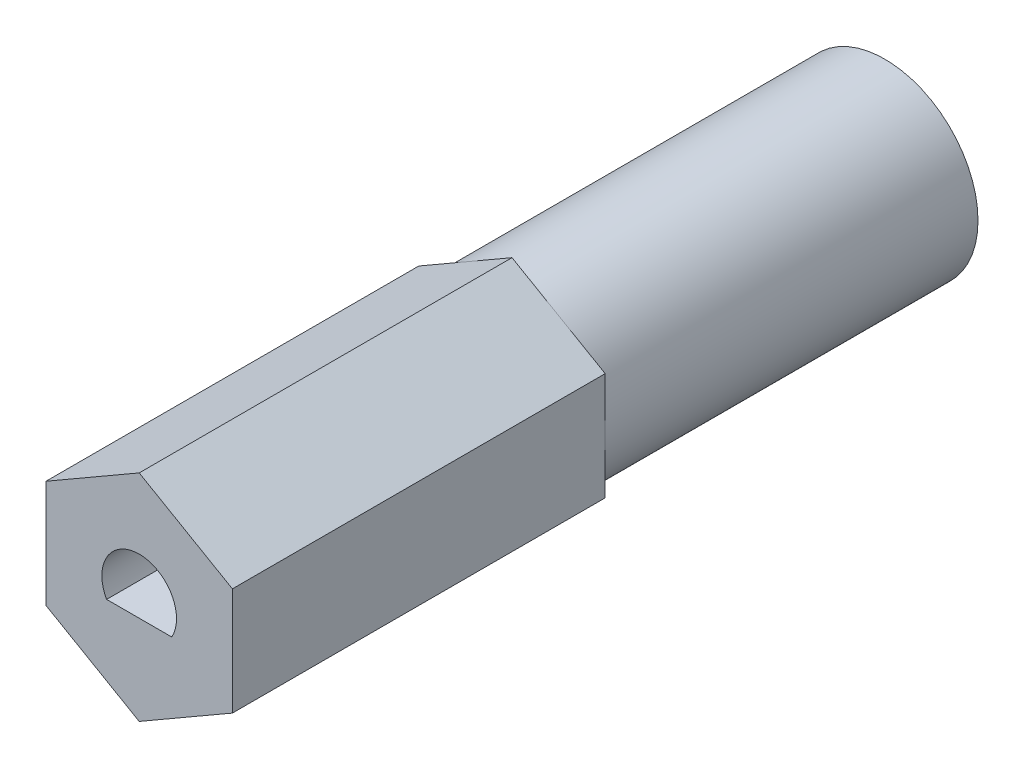
ISO-10303-21;
HEADER;
FILE_DESCRIPTION(('STEP AP214'),'2;1');
FILE_NAME('part.step','',(''),(''),'','','');
FILE_SCHEMA(('AUTOMOTIVE_DESIGN { 1 0 10303 214 1 1 1 1 }'));
ENDSEC;
DATA;
#1=APPLICATION_CONTEXT('core data for automotive mechanical design processes');
#2=APPLICATION_PROTOCOL_DEFINITION('international standard','automotive_design',2000,#1);
#3=PRODUCT_CONTEXT('',#1,'mechanical');
#4=PRODUCT('Part','Part','',(#3));
#5=PRODUCT_RELATED_PRODUCT_CATEGORY('part','',(#4));
#6=PRODUCT_DEFINITION_FORMATION('','',#4);
#7=PRODUCT_DEFINITION_CONTEXT('part definition',#1,'design');
#8=PRODUCT_DEFINITION('design','',#6,#7);
#9=PRODUCT_DEFINITION_SHAPE('','',#8);
#10=(LENGTH_UNIT() NAMED_UNIT(*) SI_UNIT(.MILLI.,.METRE.));
#11=(NAMED_UNIT(*) PLANE_ANGLE_UNIT() SI_UNIT($,.RADIAN.));
#12=(NAMED_UNIT(*) SI_UNIT($,.STERADIAN.) SOLID_ANGLE_UNIT());
#13=UNCERTAINTY_MEASURE_WITH_UNIT(LENGTH_MEASURE(1.E-05),#10,'distance_accuracy_value','');
#14=(GEOMETRIC_REPRESENTATION_CONTEXT(3) GLOBAL_UNCERTAINTY_ASSIGNED_CONTEXT((#13)) GLOBAL_UNIT_ASSIGNED_CONTEXT((#10,
#11,#12)) REPRESENTATION_CONTEXT('',''));
#15=CARTESIAN_POINT('',(0.,0.,0.));
#16=DIRECTION('',(0.,0.,1.));
#17=DIRECTION('',(1.,0.,0.));
#18=AXIS2_PLACEMENT_3D('',#15,#16,#17);
#19=CARTESIAN_POINT('',(3.175,1.83308710467706,-25.4));
#20=DIRECTION('',(0.5,0.866025403784439,0.));
#21=DIRECTION('',(-0.866025403784439,0.5,0.));
#22=AXIS2_PLACEMENT_3D('',#19,#20,#21);
#23=PLANE('',#22);
#24=DIRECTION('',(0.866025403784439,-0.5,0.));
#25=VECTOR('',#24,1.);
#26=CARTESIAN_POINT('',(3.175,1.83308710467706,-12.7));
#27=LINE('',#26,#25);
#28=CARTESIAN_POINT('',(0.,3.66617420935412,-12.7));
#29=VERTEX_POINT('',#28);
#30=CARTESIAN_POINT('',(1.5875,2.74963065701559,-12.7));
#31=VERTEX_POINT('',#30);
#32=EDGE_CURVE('E151',#29,#31,#27,.T.);
#33=ORIENTED_EDGE('',*,*,#32,.F.);
#34=DIRECTION('',(0.,0.,1.));
#35=VECTOR('',#34,1.);
#36=CARTESIAN_POINT('',(0.,3.66617420935412,-25.4));
#37=LINE('',#36,#35);
#38=CARTESIAN_POINT('',(0.,3.66617420935412,0.));
#39=VERTEX_POINT('',#38);
#40=EDGE_CURVE('E184',#29,#39,#37,.T.);
#41=ORIENTED_EDGE('',*,*,#40,.T.);
#42=DIRECTION('',(-0.866025403784439,0.5,0.));
#43=VECTOR('',#42,1.);
#44=CARTESIAN_POINT('',(3.175,1.83308710467706,0.));
#45=LINE('',#44,#43);
#46=CARTESIAN_POINT('',(3.175,1.83308710467706,0.));
#47=VERTEX_POINT('',#46);
#48=EDGE_CURVE('E165',#47,#39,#45,.T.);
#49=ORIENTED_EDGE('',*,*,#48,.F.);
#50=DIRECTION('',(0.,0.,1.));
#51=VECTOR('',#50,1.);
#52=CARTESIAN_POINT('',(3.175,1.83308710467706,-25.4));
#53=LINE('',#52,#51);
#54=CARTESIAN_POINT('',(3.175,1.83308710467706,-12.7));
#55=VERTEX_POINT('',#54);
#56=EDGE_CURVE('E185',#55,#47,#53,.T.);
#57=ORIENTED_EDGE('',*,*,#56,.F.);
#58=EDGE_CURVE('E122',#31,#55,#27,.T.);
#59=ORIENTED_EDGE('',*,*,#58,.F.);
#60=EDGE_LOOP('',(#33,#41,#49,#57,#59));
#61=FACE_BOUND('',#60,.T.);
#62=ADVANCED_FACE('F34',(#61),#23,.T.);
#63=CARTESIAN_POINT('',(3.175,-1.83308710467706,-25.4));
#64=DIRECTION('',(1.,0.,0.));
#65=DIRECTION('',(0.,1.,0.));
#66=AXIS2_PLACEMENT_3D('',#63,#64,#65);
#67=PLANE('',#66);
#68=DIRECTION('',(0.,-1.,0.));
#69=VECTOR('',#68,1.);
#70=CARTESIAN_POINT('',(3.175,-1.83308710467706,-12.7));
#71=LINE('',#70,#69);
#72=CARTESIAN_POINT('',(3.175,0.,-12.7));
#73=VERTEX_POINT('',#72);
#74=EDGE_CURVE('E116',#55,#73,#71,.T.);
#75=ORIENTED_EDGE('',*,*,#74,.F.);
#76=ORIENTED_EDGE('',*,*,#56,.T.);
#77=DIRECTION('',(0.,1.,0.));
#78=VECTOR('',#77,1.);
#79=CARTESIAN_POINT('',(3.175,-1.83308710467706,0.));
#80=LINE('',#79,#78);
#81=CARTESIAN_POINT('',(3.175,-1.83308710467706,0.));
#82=VERTEX_POINT('',#81);
#83=EDGE_CURVE('E181',#82,#47,#80,.T.);
#84=ORIENTED_EDGE('',*,*,#83,.F.);
#85=DIRECTION('',(0.,0.,1.));
#86=VECTOR('',#85,1.);
#87=CARTESIAN_POINT('',(3.175,-1.83308710467706,-25.4));
#88=LINE('',#87,#86);
#89=CARTESIAN_POINT('',(3.175,-1.83308710467706,-12.7));
#90=VERTEX_POINT('',#89);
#91=EDGE_CURVE('E145',#90,#82,#88,.T.);
#92=ORIENTED_EDGE('',*,*,#91,.F.);
#93=EDGE_CURVE('E126',#73,#90,#71,.T.);
#94=ORIENTED_EDGE('',*,*,#93,.F.);
#95=EDGE_LOOP('',(#75,#76,#84,#92,#94));
#96=FACE_BOUND('',#95,.T.);
#97=ADVANCED_FACE('F143',(#96),#67,.T.);
#98=CARTESIAN_POINT('',(0.,-3.66617420935412,-25.4));
#99=DIRECTION('',(0.5,-0.866025403784438,0.));
#100=DIRECTION('',(0.866025403784439,0.5,0.));
#101=AXIS2_PLACEMENT_3D('',#98,#99,#100);
#102=PLANE('',#101);
#103=DIRECTION('',(-0.866025403784439,-0.5,0.));
#104=VECTOR('',#103,1.);
#105=CARTESIAN_POINT('',(0.,-3.66617420935412,-12.7));
#106=LINE('',#105,#104);
#107=CARTESIAN_POINT('',(1.5875,-2.74963065701559,-12.7));
#108=VERTEX_POINT('',#107);
#109=EDGE_CURVE('E133',#90,#108,#106,.T.);
#110=ORIENTED_EDGE('',*,*,#109,.F.);
#111=ORIENTED_EDGE('',*,*,#91,.T.);
#112=DIRECTION('',(0.866025403784439,0.5,0.));
#113=VECTOR('',#112,1.);
#114=CARTESIAN_POINT('',(0.,-3.66617420935412,0.));
#115=LINE('',#114,#113);
#116=CARTESIAN_POINT('',(0.,-3.66617420935412,0.));
#117=VERTEX_POINT('',#116);
#118=EDGE_CURVE('E178',#117,#82,#115,.T.);
#119=ORIENTED_EDGE('',*,*,#118,.F.);
#120=DIRECTION('',(0.,0.,1.));
#121=VECTOR('',#120,1.);
#122=CARTESIAN_POINT('',(0.,-3.66617420935412,-25.4));
#123=LINE('',#122,#121);
#124=CARTESIAN_POINT('',(0.,-3.66617420935412,-12.7));
#125=VERTEX_POINT('',#124);
#126=EDGE_CURVE('E189',#125,#117,#123,.T.);
#127=ORIENTED_EDGE('',*,*,#126,.F.);
#128=EDGE_CURVE('E146',#108,#125,#106,.T.);
#129=ORIENTED_EDGE('',*,*,#128,.F.);
#130=EDGE_LOOP('',(#110,#111,#119,#127,#129));
#131=FACE_BOUND('',#130,.T.);
#132=ADVANCED_FACE('F215',(#131),#102,.T.);
#133=CARTESIAN_POINT('',(-3.175,-1.83308710467706,-25.4));
#134=DIRECTION('',(-0.5,-0.866025403784439,0.));
#135=DIRECTION('',(0.866025403784439,-0.5,0.));
#136=AXIS2_PLACEMENT_3D('',#133,#134,#135);
#137=PLANE('',#136);
#138=DIRECTION('',(-0.866025403784439,0.5,0.));
#139=VECTOR('',#138,1.);
#140=CARTESIAN_POINT('',(-3.175,-1.83308710467706,-12.7));
#141=LINE('',#140,#139);
#142=CARTESIAN_POINT('',(-1.5875,-2.74963065701559,-12.7));
#143=VERTEX_POINT('',#142);
#144=EDGE_CURVE('E219',#125,#143,#141,.T.);
#145=ORIENTED_EDGE('',*,*,#144,.F.);
#146=ORIENTED_EDGE('',*,*,#126,.T.);
#147=DIRECTION('',(0.866025403784439,-0.5,0.));
#148=VECTOR('',#147,1.);
#149=CARTESIAN_POINT('',(-3.175,-1.83308710467706,0.));
#150=LINE('',#149,#148);
#151=CARTESIAN_POINT('',(-3.175,-1.83308710467706,0.));
#152=VERTEX_POINT('',#151);
#153=EDGE_CURVE('E175',#152,#117,#150,.T.);
#154=ORIENTED_EDGE('',*,*,#153,.F.);
#155=DIRECTION('',(0.,0.,1.));
#156=VECTOR('',#155,1.);
#157=CARTESIAN_POINT('',(-3.175,-1.83308710467706,-25.4));
#158=LINE('',#157,#156);
#159=CARTESIAN_POINT('',(-3.175,-1.83308710467706,-12.7));
#160=VERTEX_POINT('',#159);
#161=EDGE_CURVE('E191',#160,#152,#158,.T.);
#162=ORIENTED_EDGE('',*,*,#161,.F.);
#163=EDGE_CURVE('E220',#143,#160,#141,.T.);
#164=ORIENTED_EDGE('',*,*,#163,.F.);
#165=EDGE_LOOP('',(#145,#146,#154,#162,#164));
#166=FACE_BOUND('',#165,.T.);
#167=ADVANCED_FACE('F239',(#166),#137,.T.);
#168=CARTESIAN_POINT('',(-3.175,1.83308710467706,-25.4));
#169=DIRECTION('',(-1.,0.,0.));
#170=DIRECTION('',(0.,-1.,0.));
#171=AXIS2_PLACEMENT_3D('',#168,#169,#170);
#172=PLANE('',#171);
#173=DIRECTION('',(0.,1.,0.));
#174=VECTOR('',#173,1.);
#175=CARTESIAN_POINT('',(-3.175,1.83308710467706,-12.7));
#176=LINE('',#175,#174);
#177=CARTESIAN_POINT('',(-3.175,0.,-12.7));
#178=VERTEX_POINT('',#177);
#179=EDGE_CURVE('E221',#160,#178,#176,.T.);
#180=ORIENTED_EDGE('',*,*,#179,.F.);
#181=ORIENTED_EDGE('',*,*,#161,.T.);
#182=DIRECTION('',(0.,-1.,0.));
#183=VECTOR('',#182,1.);
#184=CARTESIAN_POINT('',(-3.175,1.83308710467706,0.));
#185=LINE('',#184,#183);
#186=CARTESIAN_POINT('',(-3.175,1.83308710467706,0.));
#187=VERTEX_POINT('',#186);
#188=EDGE_CURVE('E172',#187,#152,#185,.T.);
#189=ORIENTED_EDGE('',*,*,#188,.F.);
#190=DIRECTION('',(0.,0.,1.));
#191=VECTOR('',#190,1.);
#192=CARTESIAN_POINT('',(-3.175,1.83308710467706,-25.4));
#193=LINE('',#192,#191);
#194=CARTESIAN_POINT('',(-3.175,1.83308710467706,-12.7));
#195=VERTEX_POINT('',#194);
#196=EDGE_CURVE('E193',#195,#187,#193,.T.);
#197=ORIENTED_EDGE('',*,*,#196,.F.);
#198=EDGE_CURVE('E141',#178,#195,#176,.T.);
#199=ORIENTED_EDGE('',*,*,#198,.F.);
#200=EDGE_LOOP('',(#180,#181,#189,#197,#199));
#201=FACE_BOUND('',#200,.T.);
#202=ADVANCED_FACE('F237',(#201),#172,.T.);
#203=CARTESIAN_POINT('',(0.,3.66617420935412,-25.4));
#204=DIRECTION('',(-0.5,0.866025403784439,0.));
#205=DIRECTION('',(-0.866025403784439,-0.5,0.));
#206=AXIS2_PLACEMENT_3D('',#203,#204,#205);
#207=PLANE('',#206);
#208=DIRECTION('',(0.866025403784439,0.5,0.));
#209=VECTOR('',#208,1.);
#210=CARTESIAN_POINT('',(0.,3.66617420935412,-12.7));
#211=LINE('',#210,#209);
#212=CARTESIAN_POINT('',(-1.5875,2.74963065701559,-12.7));
#213=VERTEX_POINT('',#212);
#214=EDGE_CURVE('E12',#195,#213,#211,.T.);
#215=ORIENTED_EDGE('',*,*,#214,.F.);
#216=ORIENTED_EDGE('',*,*,#196,.T.);
#217=DIRECTION('',(-0.866025403784439,-0.5,0.));
#218=VECTOR('',#217,1.);
#219=CARTESIAN_POINT('',(0.,3.66617420935412,0.));
#220=LINE('',#219,#218);
#221=EDGE_CURVE('E169',#39,#187,#220,.T.);
#222=ORIENTED_EDGE('',*,*,#221,.F.);
#223=ORIENTED_EDGE('',*,*,#40,.F.);
#224=EDGE_CURVE('E37',#213,#29,#211,.T.);
#225=ORIENTED_EDGE('',*,*,#224,.F.);
#226=EDGE_LOOP('',(#215,#216,#222,#223,#225));
#227=FACE_BOUND('',#226,.T.);
#228=ADVANCED_FACE('F206',(#227),#207,.T.);
#229=CARTESIAN_POINT('',(0.,0.,0.));
#230=DIRECTION('',(0.,0.,1.));
#231=DIRECTION('',(1.,0.,0.));
#232=AXIS2_PLACEMENT_3D('',#229,#230,#231);
#233=PLANE('',#232);
#234=CARTESIAN_POINT('',(0.,0.,0.));
#235=DIRECTION('',(0.,0.,1.));
#236=DIRECTION('',(1.,0.,0.));
#237=AXIS2_PLACEMENT_3D('',#234,#235,#236);
#238=CIRCLE('',#237,1.2716256);
#239=CARTESIAN_POINT('',(1.10986258417878,-0.6206744,0.));
#240=VERTEX_POINT('',#239);
#241=CARTESIAN_POINT('',(-1.10986258417878,-0.6206744,0.));
#242=VERTEX_POINT('',#241);
#243=EDGE_CURVE('E56',#240,#242,#238,.T.);
#244=ORIENTED_EDGE('',*,*,#243,.F.);
#245=DIRECTION('',(1.,0.,0.));
#246=VECTOR('',#245,1.);
#247=CARTESIAN_POINT('',(-1.10986258417878,-0.6206744,0.));
#248=LINE('',#247,#246);
#249=EDGE_CURVE('E156',#242,#240,#248,.T.);
#250=ORIENTED_EDGE('',*,*,#249,.F.);
#251=EDGE_LOOP('',(#244,#250));
#252=FACE_BOUND('',#251,.T.);
#253=ORIENTED_EDGE('',*,*,#48,.T.);
#254=ORIENTED_EDGE('',*,*,#221,.T.);
#255=ORIENTED_EDGE('',*,*,#188,.T.);
#256=ORIENTED_EDGE('',*,*,#153,.T.);
#257=ORIENTED_EDGE('',*,*,#118,.T.);
#258=ORIENTED_EDGE('',*,*,#83,.T.);
#259=EDGE_LOOP('',(#253,#254,#255,#256,#257,#258));
#260=FACE_BOUND('',#259,.T.);
#261=ADVANCED_FACE('F210',(#252,#260),#233,.T.);
#262=CARTESIAN_POINT('',(0.,0.,-5.08));
#263=DIRECTION('',(0.,0.,1.));
#264=DIRECTION('',(1.,0.,0.));
#265=AXIS2_PLACEMENT_3D('',#262,#263,#264);
#266=CYLINDRICAL_SURFACE('',#265,1.2716256);
#267=ORIENTED_EDGE('',*,*,#243,.T.);
#268=DIRECTION('',(0.,0.,1.));
#269=VECTOR('',#268,1.);
#270=CARTESIAN_POINT('',(-1.10986258417878,-0.6206744,-5.08));
#271=LINE('',#270,#269);
#272=CARTESIAN_POINT('',(-1.10986258417878,-0.6206744,-5.08));
#273=VERTEX_POINT('',#272);
#274=EDGE_CURVE('E159',#273,#242,#271,.T.);
#275=ORIENTED_EDGE('',*,*,#274,.F.);
#276=CARTESIAN_POINT('',(0.,0.,-5.08));
#277=DIRECTION('',(0.,0.,1.));
#278=DIRECTION('',(1.,0.,0.));
#279=AXIS2_PLACEMENT_3D('',#276,#277,#278);
#280=CIRCLE('',#279,1.2716256);
#281=CARTESIAN_POINT('',(1.10986258417878,-0.6206744,-5.08));
#282=VERTEX_POINT('',#281);
#283=EDGE_CURVE('E152',#282,#273,#280,.T.);
#284=ORIENTED_EDGE('',*,*,#283,.F.);
#285=DIRECTION('',(0.,0.,1.));
#286=VECTOR('',#285,1.);
#287=CARTESIAN_POINT('',(1.10986258417878,-0.6206744,-5.08));
#288=LINE('',#287,#286);
#289=EDGE_CURVE('E163',#282,#240,#288,.T.);
#290=ORIENTED_EDGE('',*,*,#289,.T.);
#291=EDGE_LOOP('',(#267,#275,#284,#290));
#292=FACE_BOUND('',#291,.T.);
#293=ADVANCED_FACE('F258',(#292),#266,.F.);
#294=CARTESIAN_POINT('',(-1.10986258417878,-0.6206744,-5.08));
#295=DIRECTION('',(0.,-1.,0.));
#296=DIRECTION('',(0.,0.,-1.));
#297=AXIS2_PLACEMENT_3D('',#294,#295,#296);
#298=PLANE('',#297);
#299=ORIENTED_EDGE('',*,*,#249,.T.);
#300=ORIENTED_EDGE('',*,*,#289,.F.);
#301=DIRECTION('',(1.,0.,0.));
#302=VECTOR('',#301,1.);
#303=CARTESIAN_POINT('',(-1.10986258417878,-0.6206744,-5.08));
#304=LINE('',#303,#302);
#305=EDGE_CURVE('E155',#273,#282,#304,.T.);
#306=ORIENTED_EDGE('',*,*,#305,.F.);
#307=ORIENTED_EDGE('',*,*,#274,.T.);
#308=EDGE_LOOP('',(#299,#300,#306,#307));
#309=FACE_BOUND('',#308,.T.);
#310=ADVANCED_FACE('F266',(#309),#298,.F.);
#311=CARTESIAN_POINT('',(0.,0.,-5.08));
#312=DIRECTION('',(0.,0.,1.));
#313=DIRECTION('',(1.,0.,0.));
#314=AXIS2_PLACEMENT_3D('',#311,#312,#313);
#315=PLANE('',#314);
#316=ORIENTED_EDGE('',*,*,#283,.T.);
#317=ORIENTED_EDGE('',*,*,#305,.T.);
#318=EDGE_LOOP('',(#316,#317));
#319=FACE_BOUND('',#318,.T.);
#320=ADVANCED_FACE('F269',(#319),#315,.T.);
#321=CARTESIAN_POINT('',(0.,0.,-12.7));
#322=DIRECTION('',(0.,0.,1.));
#323=DIRECTION('',(1.,0.,0.));
#324=AXIS2_PLACEMENT_3D('',#321,#322,#323);
#325=PLANE('',#324);
#326=ORIENTED_EDGE('',*,*,#32,.T.);
#327=CARTESIAN_POINT('',(0.,0.,-12.7));
#328=DIRECTION('',(0.,0.,1.));
#329=DIRECTION('',(1.,0.,0.));
#330=AXIS2_PLACEMENT_3D('',#327,#328,#329);
#331=CIRCLE('',#330,3.175);
#332=EDGE_CURVE('E48',#31,#213,#331,.T.);
#333=ORIENTED_EDGE('',*,*,#332,.T.);
#334=ORIENTED_EDGE('',*,*,#224,.T.);
#335=EDGE_LOOP('',(#326,#333,#334));
#336=FACE_BOUND('',#335,.T.);
#337=ADVANCED_FACE('F199',(#336),#325,.F.);
#338=ORIENTED_EDGE('',*,*,#58,.T.);
#339=ORIENTED_EDGE('',*,*,#74,.T.);
#340=EDGE_CURVE('E120',#73,#31,#331,.T.);
#341=ORIENTED_EDGE('',*,*,#340,.T.);
#342=EDGE_LOOP('',(#338,#339,#341));
#343=FACE_BOUND('',#342,.T.);
#344=ADVANCED_FACE('F118',(#343),#325,.F.);
#345=ORIENTED_EDGE('',*,*,#93,.T.);
#346=ORIENTED_EDGE('',*,*,#109,.T.);
#347=EDGE_CURVE('E130',#108,#73,#331,.T.);
#348=ORIENTED_EDGE('',*,*,#347,.T.);
#349=EDGE_LOOP('',(#345,#346,#348));
#350=FACE_BOUND('',#349,.T.);
#351=ADVANCED_FACE('F131',(#350),#325,.F.);
#352=ORIENTED_EDGE('',*,*,#128,.T.);
#353=ORIENTED_EDGE('',*,*,#144,.T.);
#354=EDGE_CURVE('E137',#143,#108,#331,.T.);
#355=ORIENTED_EDGE('',*,*,#354,.T.);
#356=EDGE_LOOP('',(#352,#353,#355));
#357=FACE_BOUND('',#356,.T.);
#358=ADVANCED_FACE('F280',(#357),#325,.F.);
#359=ORIENTED_EDGE('',*,*,#163,.T.);
#360=ORIENTED_EDGE('',*,*,#179,.T.);
#361=EDGE_CURVE('E231',#178,#143,#331,.T.);
#362=ORIENTED_EDGE('',*,*,#361,.T.);
#363=EDGE_LOOP('',(#359,#360,#362));
#364=FACE_BOUND('',#363,.T.);
#365=ADVANCED_FACE('F230',(#364),#325,.F.);
#366=CARTESIAN_POINT('',(0.,0.,-25.4));
#367=DIRECTION('',(0.,0.,1.));
#368=DIRECTION('',(1.,0.,0.));
#369=AXIS2_PLACEMENT_3D('',#366,#367,#368);
#370=CYLINDRICAL_SURFACE('',#369,3.175);
#371=ORIENTED_EDGE('',*,*,#332,.F.);
#372=ORIENTED_EDGE('',*,*,#340,.F.);
#373=ORIENTED_EDGE('',*,*,#347,.F.);
#374=ORIENTED_EDGE('',*,*,#354,.F.);
#375=ORIENTED_EDGE('',*,*,#361,.F.);
#376=EDGE_CURVE('E235',#213,#178,#331,.T.);
#377=ORIENTED_EDGE('',*,*,#376,.F.);
#378=EDGE_LOOP('',(#371,#372,#373,#374,#375,#377));
#379=FACE_BOUND('',#378,.T.);
#380=CARTESIAN_POINT('',(0.,0.,-25.4));
#381=DIRECTION('',(0.,0.,1.));
#382=DIRECTION('',(1.,0.,0.));
#383=AXIS2_PLACEMENT_3D('',#380,#381,#382);
#384=CIRCLE('',#383,3.175);
#385=CARTESIAN_POINT('',(3.175,0.,-25.4));
#386=VERTEX_POINT('',#385);
#387=EDGE_CURVE('E187',#386,#386,#384,.T.);
#388=ORIENTED_EDGE('',*,*,#387,.T.);
#389=EDGE_LOOP('',(#388));
#390=FACE_BOUND('',#389,.T.);
#391=ADVANCED_FACE('F139',(#379,#390),#370,.T.);
#392=ORIENTED_EDGE('',*,*,#198,.T.);
#393=ORIENTED_EDGE('',*,*,#214,.T.);
#394=ORIENTED_EDGE('',*,*,#376,.T.);
#395=EDGE_LOOP('',(#392,#393,#394));
#396=FACE_BOUND('',#395,.T.);
#397=ADVANCED_FACE('F236',(#396),#325,.F.);
#398=CARTESIAN_POINT('',(0.,0.,-25.4));
#399=DIRECTION('',(0.,0.,1.));
#400=DIRECTION('',(1.,0.,0.));
#401=AXIS2_PLACEMENT_3D('',#398,#399,#400);
#402=PLANE('',#401);
#403=ORIENTED_EDGE('',*,*,#387,.F.);
#404=EDGE_LOOP('',(#403));
#405=FACE_BOUND('',#404,.T.);
#406=ADVANCED_FACE('F260',(#405),#402,.F.);
#407=CLOSED_SHELL('',(#62,#97,#132,#167,#202,#228,#261,#293,#310,#320,#337,#344,#351,#358,#365,
#391,#397,#406));
#408=MANIFOLD_SOLID_BREP('B2',#407);
#409=ADVANCED_BREP_SHAPE_REPRESENTATION('',(#18,#408),#14);
#410=SHAPE_DEFINITION_REPRESENTATION(#9,#409);
ENDSEC;
END-ISO-10303-21;
